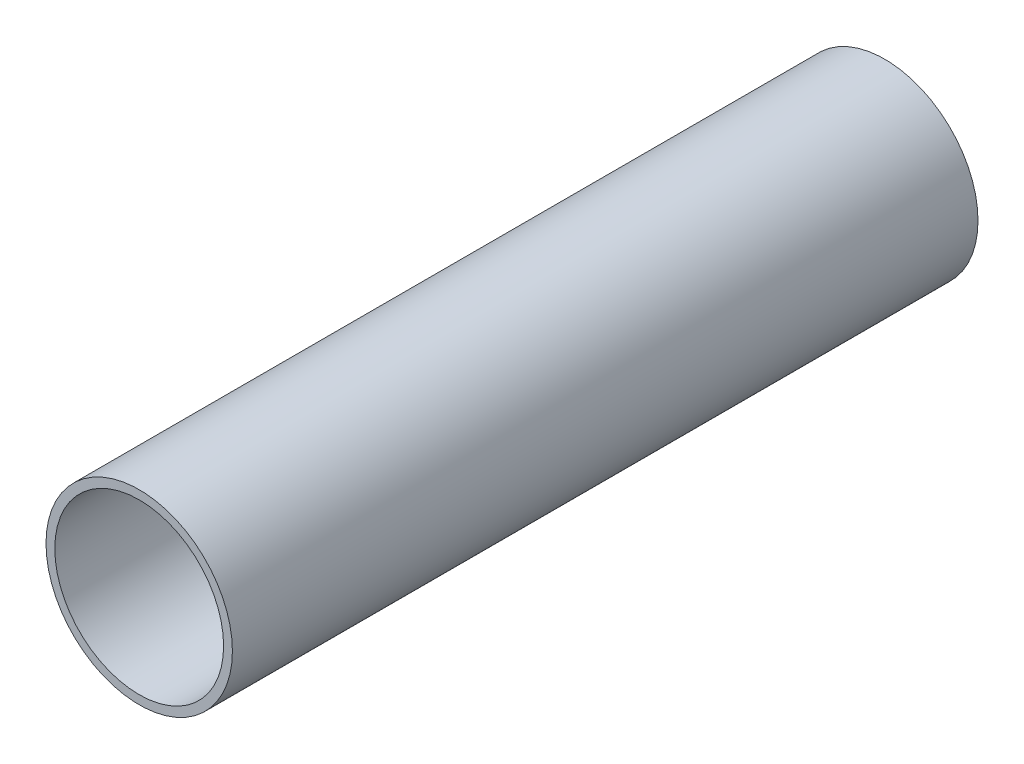
ISO-10303-21;
HEADER;
FILE_DESCRIPTION(('STEP AP214'),'2;1');
FILE_NAME('part.step','',(''),(''),'','','');
FILE_SCHEMA(('AUTOMOTIVE_DESIGN { 1 0 10303 214 1 1 1 1 }'));
ENDSEC;
DATA;
#1=APPLICATION_CONTEXT('core data for automotive mechanical design processes');
#2=APPLICATION_PROTOCOL_DEFINITION('international standard','automotive_design',2000,#1);
#3=PRODUCT_CONTEXT('',#1,'mechanical');
#4=PRODUCT('Part','Part','',(#3));
#5=PRODUCT_RELATED_PRODUCT_CATEGORY('part','',(#4));
#6=PRODUCT_DEFINITION_FORMATION('','',#4);
#7=PRODUCT_DEFINITION_CONTEXT('part definition',#1,'design');
#8=PRODUCT_DEFINITION('design','',#6,#7);
#9=PRODUCT_DEFINITION_SHAPE('','',#8);
#10=(LENGTH_UNIT() NAMED_UNIT(*) SI_UNIT(.MILLI.,.METRE.));
#11=(NAMED_UNIT(*) PLANE_ANGLE_UNIT() SI_UNIT($,.RADIAN.));
#12=(NAMED_UNIT(*) SI_UNIT($,.STERADIAN.) SOLID_ANGLE_UNIT());
#13=UNCERTAINTY_MEASURE_WITH_UNIT(LENGTH_MEASURE(1.E-05),#10,'distance_accuracy_value','');
#14=(GEOMETRIC_REPRESENTATION_CONTEXT(3) GLOBAL_UNCERTAINTY_ASSIGNED_CONTEXT((#13)) GLOBAL_UNIT_ASSIGNED_CONTEXT((#10,
#11,#12)) REPRESENTATION_CONTEXT('',''));
#15=CARTESIAN_POINT('',(0.,0.,0.));
#16=DIRECTION('',(0.,0.,1.));
#17=DIRECTION('',(1.,0.,0.));
#18=AXIS2_PLACEMENT_3D('',#15,#16,#17);
#19=CARTESIAN_POINT('',(0.,0.,673.1));
#20=DIRECTION('',(0.,0.,1.));
#21=DIRECTION('',(1.,0.,0.));
#22=AXIS2_PLACEMENT_3D('',#19,#20,#21);
#23=PLANE('',#22);
#24=CARTESIAN_POINT('',(0.,0.,673.1));
#25=DIRECTION('',(0.,0.,1.));
#26=DIRECTION('',(1.,0.,0.));
#27=AXIS2_PLACEMENT_3D('',#24,#25,#26);
#28=CIRCLE('',#27,84.1375);
#29=CARTESIAN_POINT('',(84.1375,0.,673.1));
#30=VERTEX_POINT('',#29);
#31=EDGE_CURVE('E10',#30,#30,#28,.T.);
#32=ORIENTED_EDGE('',*,*,#31,.T.);
#33=EDGE_LOOP('',(#32));
#34=FACE_BOUND('',#33,.T.);
#35=CARTESIAN_POINT('',(0.,0.,673.1));
#36=DIRECTION('',(0.,0.,1.));
#37=DIRECTION('',(1.,0.,0.));
#38=AXIS2_PLACEMENT_3D('',#35,#36,#37);
#39=CIRCLE('',#38,76.2);
#40=CARTESIAN_POINT('',(76.2,0.,673.1));
#41=VERTEX_POINT('',#40);
#42=EDGE_CURVE('E55',#41,#41,#39,.T.);
#43=ORIENTED_EDGE('',*,*,#42,.F.);
#44=EDGE_LOOP('',(#43));
#45=FACE_BOUND('',#44,.T.);
#46=ADVANCED_FACE('F42',(#34,#45),#23,.T.);
#47=CARTESIAN_POINT('',(0.,0.,0.));
#48=DIRECTION('',(0.,0.,1.));
#49=DIRECTION('',(1.,0.,0.));
#50=AXIS2_PLACEMENT_3D('',#47,#48,#49);
#51=PLANE('',#50);
#52=CARTESIAN_POINT('',(0.,0.,0.));
#53=DIRECTION('',(0.,0.,1.));
#54=DIRECTION('',(1.,0.,0.));
#55=AXIS2_PLACEMENT_3D('',#52,#53,#54);
#56=CIRCLE('',#55,84.1375);
#57=CARTESIAN_POINT('',(84.1375,0.,0.));
#58=VERTEX_POINT('',#57);
#59=EDGE_CURVE('E46',#58,#58,#56,.T.);
#60=ORIENTED_EDGE('',*,*,#59,.F.);
#61=EDGE_LOOP('',(#60));
#62=FACE_BOUND('',#61,.T.);
#63=CARTESIAN_POINT('',(0.,0.,0.));
#64=DIRECTION('',(0.,0.,1.));
#65=DIRECTION('',(1.,0.,0.));
#66=AXIS2_PLACEMENT_3D('',#63,#64,#65);
#67=CIRCLE('',#66,76.2);
#68=CARTESIAN_POINT('',(76.2,0.,0.));
#69=VERTEX_POINT('',#68);
#70=EDGE_CURVE('E57',#69,#69,#67,.T.);
#71=ORIENTED_EDGE('',*,*,#70,.T.);
#72=EDGE_LOOP('',(#71));
#73=FACE_BOUND('',#72,.T.);
#74=ADVANCED_FACE('F69',(#62,#73),#51,.F.);
#75=CARTESIAN_POINT('',(0.,0.,673.1));
#76=DIRECTION('',(0.,0.,-1.));
#77=DIRECTION('',(-1.,0.,0.));
#78=AXIS2_PLACEMENT_3D('',#75,#76,#77);
#79=CYLINDRICAL_SURFACE('',#78,84.1375);
#80=ORIENTED_EDGE('',*,*,#31,.F.);
#81=EDGE_LOOP('',(#80));
#82=FACE_BOUND('',#81,.T.);
#83=ORIENTED_EDGE('',*,*,#59,.T.);
#84=EDGE_LOOP('',(#83));
#85=FACE_BOUND('',#84,.T.);
#86=ADVANCED_FACE('F44',(#82,#85),#79,.T.);
#87=CARTESIAN_POINT('',(0.,0.,673.1));
#88=DIRECTION('',(0.,0.,-1.));
#89=DIRECTION('',(-1.,0.,0.));
#90=AXIS2_PLACEMENT_3D('',#87,#88,#89);
#91=CYLINDRICAL_SURFACE('',#90,76.2);
#92=ORIENTED_EDGE('',*,*,#42,.T.);
#93=EDGE_LOOP('',(#92));
#94=FACE_BOUND('',#93,.T.);
#95=ORIENTED_EDGE('',*,*,#70,.F.);
#96=EDGE_LOOP('',(#95));
#97=FACE_BOUND('',#96,.T.);
#98=ADVANCED_FACE('F65',(#94,#97),#91,.F.);
#99=CLOSED_SHELL('',(#46,#74,#86,#98));
#100=MANIFOLD_SOLID_BREP('B2',#99);
#101=ADVANCED_BREP_SHAPE_REPRESENTATION('',(#18,#100),#14);
#102=SHAPE_DEFINITION_REPRESENTATION(#9,#101);
ENDSEC;
END-ISO-10303-21;
